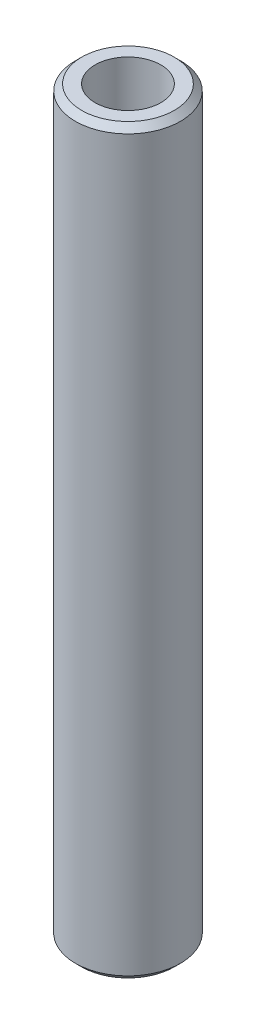
ISO-10303-21;
HEADER;
FILE_DESCRIPTION(('STEP AP214'),'2;1');
FILE_NAME('part.step','',(''),(''),'','','');
FILE_SCHEMA(('AUTOMOTIVE_DESIGN { 1 0 10303 214 1 1 1 1 }'));
ENDSEC;
DATA;
#1=APPLICATION_CONTEXT('core data for automotive mechanical design processes');
#2=APPLICATION_PROTOCOL_DEFINITION('international standard','automotive_design',2000,#1);
#3=PRODUCT_CONTEXT('',#1,'mechanical');
#4=PRODUCT('Part','Part','',(#3));
#5=PRODUCT_RELATED_PRODUCT_CATEGORY('part','',(#4));
#6=PRODUCT_DEFINITION_FORMATION('','',#4);
#7=PRODUCT_DEFINITION_CONTEXT('part definition',#1,'design');
#8=PRODUCT_DEFINITION('design','',#6,#7);
#9=PRODUCT_DEFINITION_SHAPE('','',#8);
#10=(LENGTH_UNIT() NAMED_UNIT(*) SI_UNIT(.MILLI.,.METRE.));
#11=(NAMED_UNIT(*) PLANE_ANGLE_UNIT() SI_UNIT($,.RADIAN.));
#12=(NAMED_UNIT(*) SI_UNIT($,.STERADIAN.) SOLID_ANGLE_UNIT());
#13=UNCERTAINTY_MEASURE_WITH_UNIT(LENGTH_MEASURE(1.E-05),#10,'distance_accuracy_value','');
#14=(GEOMETRIC_REPRESENTATION_CONTEXT(3) GLOBAL_UNCERTAINTY_ASSIGNED_CONTEXT((#13)) GLOBAL_UNIT_ASSIGNED_CONTEXT((#10,
#11,#12)) REPRESENTATION_CONTEXT('',''));
#15=CARTESIAN_POINT('',(0.,0.,0.));
#16=DIRECTION('',(0.,0.,1.));
#17=DIRECTION('',(1.,0.,0.));
#18=AXIS2_PLACEMENT_3D('',#15,#16,#17);
#19=CARTESIAN_POINT('',(0.,600.,0.));
#20=DIRECTION('',(0.,-1.,0.));
#21=DIRECTION('',(0.,0.,-1.));
#22=AXIS2_PLACEMENT_3D('',#19,#20,#21);
#23=CYLINDRICAL_SURFACE('',#22,42.5);
#24=CARTESIAN_POINT('',(0.,594.916934351764,0.));
#25=DIRECTION('',(0.,1.,0.));
#26=DIRECTION('',(0.,0.,1.));
#27=AXIS2_PLACEMENT_3D('',#24,#25,#26);
#28=CIRCLE('',#27,42.5);
#29=CARTESIAN_POINT('',(0.,594.916934351764,42.5));
#30=VERTEX_POINT('',#29);
#31=EDGE_CURVE('E50',#30,#30,#28,.F.);
#32=ORIENTED_EDGE('',*,*,#31,.T.);
#33=EDGE_LOOP('',(#32));
#34=FACE_BOUND('',#33,.T.);
#35=CARTESIAN_POINT('',(0.,5.08306564823613,0.));
#36=DIRECTION('',(0.,1.,0.));
#37=DIRECTION('',(0.,0.,1.));
#38=AXIS2_PLACEMENT_3D('',#35,#36,#37);
#39=CIRCLE('',#38,42.5);
#40=CARTESIAN_POINT('',(0.,5.08306564823613,42.5));
#41=VERTEX_POINT('',#40);
#42=EDGE_CURVE('E51',#41,#41,#39,.T.);
#43=ORIENTED_EDGE('',*,*,#42,.T.);
#44=EDGE_LOOP('',(#43));
#45=FACE_BOUND('',#44,.T.);
#46=ADVANCED_FACE('F39',(#34,#45),#23,.T.);
#47=CARTESIAN_POINT('',(0.,600.,0.));
#48=DIRECTION('',(0.,1.,0.));
#49=DIRECTION('',(0.,0.,1.));
#50=AXIS2_PLACEMENT_3D('',#47,#48,#49);
#51=PLANE('',#50);
#52=CARTESIAN_POINT('',(0.,600.,0.));
#53=DIRECTION('',(0.,1.,0.));
#54=DIRECTION('',(0.,0.,1.));
#55=AXIS2_PLACEMENT_3D('',#52,#53,#54);
#56=CIRCLE('',#55,37.4169343517636);
#57=CARTESIAN_POINT('',(0.,600.,37.4169343517636));
#58=VERTEX_POINT('',#57);
#59=EDGE_CURVE('E54',#58,#58,#56,.T.);
#60=ORIENTED_EDGE('',*,*,#59,.T.);
#61=EDGE_LOOP('',(#60));
#62=FACE_BOUND('',#61,.T.);
#63=CARTESIAN_POINT('',(0.,600.,0.));
#64=DIRECTION('',(0.,1.,0.));
#65=DIRECTION('',(0.,0.,1.));
#66=AXIS2_PLACEMENT_3D('',#63,#64,#65);
#67=CIRCLE('',#66,26.5685812978468);
#68=CARTESIAN_POINT('',(0.,600.,26.5685812978468));
#69=VERTEX_POINT('',#68);
#70=EDGE_CURVE('E58',#69,#69,#67,.T.);
#71=ORIENTED_EDGE('',*,*,#70,.F.);
#72=EDGE_LOOP('',(#71));
#73=FACE_BOUND('',#72,.T.);
#74=ADVANCED_FACE('F69',(#62,#73),#51,.T.);
#75=CARTESIAN_POINT('',(0.,0.,0.));
#76=DIRECTION('',(0.,1.,0.));
#77=DIRECTION('',(0.,0.,1.));
#78=AXIS2_PLACEMENT_3D('',#75,#76,#77);
#79=PLANE('',#78);
#80=CARTESIAN_POINT('',(0.,0.,0.));
#81=DIRECTION('',(0.,1.,0.));
#82=DIRECTION('',(0.,0.,1.));
#83=AXIS2_PLACEMENT_3D('',#80,#81,#82);
#84=CIRCLE('',#83,37.4169343517639);
#85=CARTESIAN_POINT('',(0.,0.,37.4169343517639));
#86=VERTEX_POINT('',#85);
#87=EDGE_CURVE('E10',#86,#86,#84,.F.);
#88=ORIENTED_EDGE('',*,*,#87,.T.);
#89=EDGE_LOOP('',(#88));
#90=FACE_BOUND('',#89,.T.);
#91=CARTESIAN_POINT('',(0.,0.,0.));
#92=DIRECTION('',(0.,1.,0.));
#93=DIRECTION('',(0.,0.,1.));
#94=AXIS2_PLACEMENT_3D('',#91,#92,#93);
#95=CIRCLE('',#94,26.5685812978468);
#96=CARTESIAN_POINT('',(0.,0.,26.5685812978468));
#97=VERTEX_POINT('',#96);
#98=EDGE_CURVE('E63',#97,#97,#95,.T.);
#99=ORIENTED_EDGE('',*,*,#98,.T.);
#100=EDGE_LOOP('',(#99));
#101=FACE_BOUND('',#100,.T.);
#102=ADVANCED_FACE('F75',(#90,#101),#79,.F.);
#103=CARTESIAN_POINT('',(0.,600.,0.));
#104=DIRECTION('',(0.,-1.,0.));
#105=DIRECTION('',(0.,0.,-1.));
#106=AXIS2_PLACEMENT_3D('',#103,#104,#105);
#107=CYLINDRICAL_SURFACE('',#106,26.5685812978468);
#108=ORIENTED_EDGE('',*,*,#70,.T.);
#109=EDGE_LOOP('',(#108));
#110=FACE_BOUND('',#109,.T.);
#111=ORIENTED_EDGE('',*,*,#98,.F.);
#112=EDGE_LOOP('',(#111));
#113=FACE_BOUND('',#112,.T.);
#114=ADVANCED_FACE('F70',(#110,#113),#107,.F.);
#115=CARTESIAN_POINT('',(0.,600.,0.));
#116=DIRECTION('',(0.,-1.,0.));
#117=DIRECTION('',(0.,0.,-1.));
#118=AXIS2_PLACEMENT_3D('',#115,#116,#117);
#119=CONICAL_SURFACE('',#118,37.4169343517636,0.78539816339744);
#120=ORIENTED_EDGE('',*,*,#31,.F.);
#121=EDGE_LOOP('',(#120));
#122=FACE_BOUND('',#121,.T.);
#123=ORIENTED_EDGE('',*,*,#59,.F.);
#124=EDGE_LOOP('',(#123));
#125=FACE_BOUND('',#124,.T.);
#126=ADVANCED_FACE('F81',(#122,#125),#119,.T.);
#127=CARTESIAN_POINT('',(0.,5.08306564823613,0.));
#128=DIRECTION('',(0.,1.,0.));
#129=DIRECTION('',(0.,0.,1.));
#130=AXIS2_PLACEMENT_3D('',#127,#128,#129);
#131=CONICAL_SURFACE('',#130,42.5,0.785398163397446);
#132=ORIENTED_EDGE('',*,*,#87,.F.);
#133=EDGE_LOOP('',(#132));
#134=FACE_BOUND('',#133,.T.);
#135=ORIENTED_EDGE('',*,*,#42,.F.);
#136=EDGE_LOOP('',(#135));
#137=FACE_BOUND('',#136,.T.);
#138=ADVANCED_FACE('F45',(#134,#137),#131,.T.);
#139=CLOSED_SHELL('',(#46,#74,#102,#114,#126,#138));
#140=MANIFOLD_SOLID_BREP('B2',#139);
#141=ADVANCED_BREP_SHAPE_REPRESENTATION('',(#18,#140),#14);
#142=SHAPE_DEFINITION_REPRESENTATION(#9,#141);
ENDSEC;
END-ISO-10303-21;
